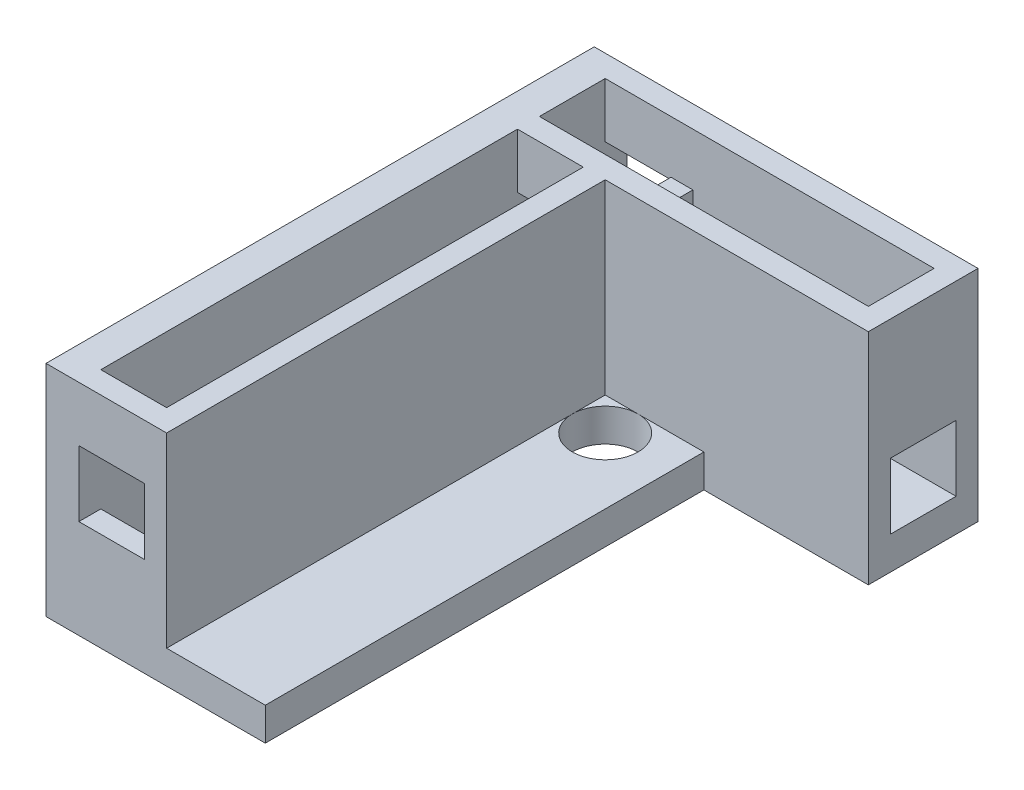
ISO-10303-21;
HEADER;
FILE_DESCRIPTION(('STEP AP214'),'2;1');
FILE_NAME('part.step','',(''),(''),'','','');
FILE_SCHEMA(('AUTOMOTIVE_DESIGN { 1 0 10303 214 1 1 1 1 }'));
ENDSEC;
DATA;
#1=APPLICATION_CONTEXT('core data for automotive mechanical design processes');
#2=APPLICATION_PROTOCOL_DEFINITION('international standard','automotive_design',2000,#1);
#3=PRODUCT_CONTEXT('',#1,'mechanical');
#4=PRODUCT('Part','Part','',(#3));
#5=PRODUCT_RELATED_PRODUCT_CATEGORY('part','',(#4));
#6=PRODUCT_DEFINITION_FORMATION('','',#4);
#7=PRODUCT_DEFINITION_CONTEXT('part definition',#1,'design');
#8=PRODUCT_DEFINITION('design','',#6,#7);
#9=PRODUCT_DEFINITION_SHAPE('','',#8);
#10=(LENGTH_UNIT() NAMED_UNIT(*) SI_UNIT(.MILLI.,.METRE.));
#11=(NAMED_UNIT(*) PLANE_ANGLE_UNIT() SI_UNIT($,.RADIAN.));
#12=(NAMED_UNIT(*) SI_UNIT($,.STERADIAN.) SOLID_ANGLE_UNIT());
#13=UNCERTAINTY_MEASURE_WITH_UNIT(LENGTH_MEASURE(1.E-05),#10,'distance_accuracy_value','');
#14=(GEOMETRIC_REPRESENTATION_CONTEXT(3) GLOBAL_UNCERTAINTY_ASSIGNED_CONTEXT((#13)) GLOBAL_UNIT_ASSIGNED_CONTEXT((#10,
#11,#12)) REPRESENTATION_CONTEXT('',''));
#15=CARTESIAN_POINT('',(0.,0.,0.));
#16=DIRECTION('',(0.,0.,1.));
#17=DIRECTION('',(1.,0.,0.));
#18=AXIS2_PLACEMENT_3D('',#15,#16,#17);
#19=CARTESIAN_POINT('',(35.,2.,10.));
#20=DIRECTION('',(0.,-1.,0.));
#21=DIRECTION('',(0.,0.,1.));
#22=AXIS2_PLACEMENT_3D('',#19,#20,#21);
#23=PLANE('',#22);
#24=DIRECTION('',(1.,0.,0.));
#25=VECTOR('',#24,1.);
#26=CARTESIAN_POINT('',(35.,2.,10.));
#27=LINE('',#26,#25);
#28=CARTESIAN_POINT('',(11.,2.,10.));
#29=VERTEX_POINT('',#28);
#30=CARTESIAN_POINT('',(14.,2.,10.));
#31=VERTEX_POINT('',#30);
#32=EDGE_CURVE('E286',#29,#31,#27,.T.);
#33=ORIENTED_EDGE('',*,*,#32,.F.);
#34=DIRECTION('',(0.,0.,-1.));
#35=VECTOR('',#34,1.);
#36=CARTESIAN_POINT('',(11.,2.,10.));
#37=LINE('',#36,#35);
#38=CARTESIAN_POINT('',(11.,2.,13.));
#39=VERTEX_POINT('',#38);
#40=EDGE_CURVE('E276',#39,#29,#37,.T.);
#41=ORIENTED_EDGE('',*,*,#40,.F.);
#42=CARTESIAN_POINT('',(14.,2.,13.));
#43=DIRECTION('',(0.,-1.,0.));
#44=DIRECTION('',(0.,0.,-1.));
#45=AXIS2_PLACEMENT_3D('',#42,#43,#44);
#46=CIRCLE('',#45,3.);
#47=EDGE_CURVE('E269',#39,#31,#46,.T.);
#48=ORIENTED_EDGE('',*,*,#47,.T.);
#49=EDGE_LOOP('',(#33,#41,#48));
#50=FACE_BOUND('',#49,.T.);
#51=ADVANCED_FACE('F33',(#50),#23,.F.);
#52=CARTESIAN_POINT('',(3.00000000000001,8.,19.3532580399902));
#53=DIRECTION('',(1.,0.,0.));
#54=DIRECTION('',(0.,0.,1.));
#55=AXIS2_PLACEMENT_3D('',#52,#53,#54);
#56=PLANE('',#55);
#57=DIRECTION('',(0.,-1.,0.));
#58=VECTOR('',#57,1.);
#59=CARTESIAN_POINT('',(3.00000000000001,14.2,50.));
#60=LINE('',#59,#58);
#61=CARTESIAN_POINT('',(3.00000000000001,14.,50.));
#62=VERTEX_POINT('',#61);
#63=CARTESIAN_POINT('',(3.00000000000001,8.,50.));
#64=VERTEX_POINT('',#63);
#65=EDGE_CURVE('E529',#62,#64,#60,.T.);
#66=ORIENTED_EDGE('',*,*,#65,.T.);
#67=DIRECTION('',(0.,0.,-1.));
#68=VECTOR('',#67,1.);
#69=CARTESIAN_POINT('',(3.00000000000001,8.,19.3532580399902));
#70=LINE('',#69,#68);
#71=CARTESIAN_POINT('',(3.00000000000001,8.,48.));
#72=VERTEX_POINT('',#71);
#73=EDGE_CURVE('E519',#64,#72,#70,.T.);
#74=ORIENTED_EDGE('',*,*,#73,.T.);
#75=DIRECTION('',(0.,-1.,0.));
#76=VECTOR('',#75,1.);
#77=CARTESIAN_POINT('',(3.00000000000001,8.,48.));
#78=LINE('',#77,#76);
#79=CARTESIAN_POINT('',(3.00000000000001,2.,48.));
#80=VERTEX_POINT('',#79);
#81=EDGE_CURVE('E421',#72,#80,#78,.T.);
#82=ORIENTED_EDGE('',*,*,#81,.T.);
#83=DIRECTION('',(0.,0.,-1.));
#84=VECTOR('',#83,1.);
#85=CARTESIAN_POINT('',(3.00000000000001,2.,10.));
#86=LINE('',#85,#84);
#87=CARTESIAN_POINT('',(3.00000000000001,2.,10.));
#88=VERTEX_POINT('',#87);
#89=EDGE_CURVE('E293',#80,#88,#86,.T.);
#90=ORIENTED_EDGE('',*,*,#89,.T.);
#91=DIRECTION('',(0.,-1.,0.));
#92=VECTOR('',#91,1.);
#93=CARTESIAN_POINT('',(3.00000000000001,8.,10.));
#94=LINE('',#93,#92);
#95=CARTESIAN_POINT('',(3.00000000000001,8.,10.));
#96=VERTEX_POINT('',#95);
#97=EDGE_CURVE('E287',#96,#88,#94,.T.);
#98=ORIENTED_EDGE('',*,*,#97,.F.);
#99=CARTESIAN_POINT('',(3.00000000000001,8.,8.));
#100=VERTEX_POINT('',#99);
#101=EDGE_CURVE('E522',#96,#100,#70,.T.);
#102=ORIENTED_EDGE('',*,*,#101,.T.);
#103=CARTESIAN_POINT('',(3.00000000000001,8.,1.99999999999999));
#104=VERTEX_POINT('',#103);
#105=EDGE_CURVE('E565',#100,#104,#70,.T.);
#106=ORIENTED_EDGE('',*,*,#105,.T.);
#107=CARTESIAN_POINT('',(3.00000000000001,8.,0.));
#108=VERTEX_POINT('',#107);
#109=EDGE_CURVE('E523',#104,#108,#70,.T.);
#110=ORIENTED_EDGE('',*,*,#109,.T.);
#111=DIRECTION('',(0.,-1.,0.));
#112=VECTOR('',#111,1.);
#113=CARTESIAN_POINT('',(3.00000000000001,14.2,0.));
#114=LINE('',#113,#112);
#115=CARTESIAN_POINT('',(3.00000000000001,14.,0.));
#116=VERTEX_POINT('',#115);
#117=EDGE_CURVE('E526',#116,#108,#114,.T.);
#118=ORIENTED_EDGE('',*,*,#117,.F.);
#119=DIRECTION('',(0.,0.,-1.));
#120=VECTOR('',#119,1.);
#121=CARTESIAN_POINT('',(3.00000000000001,14.,19.3532580399902));
#122=LINE('',#121,#120);
#123=CARTESIAN_POINT('',(3.00000000000001,14.,2.));
#124=VERTEX_POINT('',#123);
#125=EDGE_CURVE('E514',#124,#116,#122,.T.);
#126=ORIENTED_EDGE('',*,*,#125,.F.);
#127=DIRECTION('',(0.,-1.,0.));
#128=VECTOR('',#127,1.);
#129=CARTESIAN_POINT('',(3.00000000000001,19.,2.));
#130=LINE('',#129,#128);
#131=CARTESIAN_POINT('',(3.00000000000001,19.,2.));
#132=VERTEX_POINT('',#131);
#133=EDGE_CURVE('E489',#132,#124,#130,.T.);
#134=ORIENTED_EDGE('',*,*,#133,.F.);
#135=DIRECTION('',(0.,0.,-1.));
#136=VECTOR('',#135,1.);
#137=CARTESIAN_POINT('',(3.00000000000001,19.,19.3532580399902));
#138=LINE('',#137,#136);
#139=CARTESIAN_POINT('',(3.00000000000001,19.,8.));
#140=VERTEX_POINT('',#139);
#141=EDGE_CURVE('E462',#140,#132,#138,.T.);
#142=ORIENTED_EDGE('',*,*,#141,.F.);
#143=DIRECTION('',(0.,-1.,0.));
#144=VECTOR('',#143,1.);
#145=CARTESIAN_POINT('',(3.00000000000001,19.,8.));
#146=LINE('',#145,#144);
#147=CARTESIAN_POINT('',(3.00000000000001,14.,8.));
#148=VERTEX_POINT('',#147);
#149=EDGE_CURVE('E492',#140,#148,#146,.T.);
#150=ORIENTED_EDGE('',*,*,#149,.T.);
#151=CARTESIAN_POINT('',(3.00000000000001,14.,10.));
#152=VERTEX_POINT('',#151);
#153=EDGE_CURVE('E517',#152,#148,#122,.T.);
#154=ORIENTED_EDGE('',*,*,#153,.F.);
#155=DIRECTION('',(0.,-1.,0.));
#156=VECTOR('',#155,1.);
#157=CARTESIAN_POINT('',(3.00000000000001,19.,10.));
#158=LINE('',#157,#156);
#159=CARTESIAN_POINT('',(3.00000000000001,19.,10.));
#160=VERTEX_POINT('',#159);
#161=EDGE_CURVE('E476',#160,#152,#158,.T.);
#162=ORIENTED_EDGE('',*,*,#161,.F.);
#163=DIRECTION('',(0.,0.,-1.));
#164=VECTOR('',#163,1.);
#165=CARTESIAN_POINT('',(3.00000000000001,19.,19.3532580399902));
#166=LINE('',#165,#164);
#167=CARTESIAN_POINT('',(3.00000000000001,19.,48.));
#168=VERTEX_POINT('',#167);
#169=EDGE_CURVE('E488',#168,#160,#166,.T.);
#170=ORIENTED_EDGE('',*,*,#169,.F.);
#171=DIRECTION('',(0.,-1.,0.));
#172=VECTOR('',#171,1.);
#173=CARTESIAN_POINT('',(3.00000000000001,19.,48.));
#174=LINE('',#173,#172);
#175=CARTESIAN_POINT('',(3.00000000000001,14.,48.));
#176=VERTEX_POINT('',#175);
#177=EDGE_CURVE('E493',#168,#176,#174,.T.);
#178=ORIENTED_EDGE('',*,*,#177,.T.);
#179=EDGE_CURVE('E518',#62,#176,#122,.T.);
#180=ORIENTED_EDGE('',*,*,#179,.F.);
#181=EDGE_LOOP('',(#66,#74,#82,#90,#98,#102,#106,#110,#118,#126,#134,#142,#150,#154,#162,#170,
#178,#180));
#182=FACE_BOUND('',#181,.T.);
#183=ADVANCED_FACE('F433',(#182),#56,.T.);
#184=CARTESIAN_POINT('',(9.00000000000001,8.,19.3532580399902));
#185=DIRECTION('',(1.,0.,0.));
#186=DIRECTION('',(0.,0.,1.));
#187=AXIS2_PLACEMENT_3D('',#184,#185,#186);
#188=PLANE('',#187);
#189=DIRECTION('',(0.,0.,-1.));
#190=VECTOR('',#189,1.);
#191=CARTESIAN_POINT('',(9.00000000000001,14.2,19.3532580399902));
#192=LINE('',#191,#190);
#193=CARTESIAN_POINT('',(9.00000000000001,14.2,8.));
#194=VERTEX_POINT('',#193);
#195=CARTESIAN_POINT('',(9.00000000000001,14.2,2.));
#196=VERTEX_POINT('',#195);
#197=EDGE_CURVE('E382',#194,#196,#192,.T.);
#198=ORIENTED_EDGE('',*,*,#197,.T.);
#199=DIRECTION('',(0.,-1.,0.));
#200=VECTOR('',#199,1.);
#201=CARTESIAN_POINT('',(9.00000000000001,8.,1.99999999999999));
#202=LINE('',#201,#200);
#203=CARTESIAN_POINT('',(9.00000000000001,14.,2.));
#204=VERTEX_POINT('',#203);
#205=EDGE_CURVE('E377',#196,#204,#202,.T.);
#206=ORIENTED_EDGE('',*,*,#205,.T.);
#207=DIRECTION('',(0.,0.,-1.));
#208=VECTOR('',#207,1.);
#209=CARTESIAN_POINT('',(9.00000000000001,14.,19.3532580399902));
#210=LINE('',#209,#208);
#211=CARTESIAN_POINT('',(9.00000000000001,14.,0.));
#212=VERTEX_POINT('',#211);
#213=EDGE_CURVE('E509',#204,#212,#210,.T.);
#214=ORIENTED_EDGE('',*,*,#213,.T.);
#215=DIRECTION('',(0.,-1.,0.));
#216=VECTOR('',#215,1.);
#217=CARTESIAN_POINT('',(9.00000000000001,14.2,0.));
#218=LINE('',#217,#216);
#219=CARTESIAN_POINT('',(9.00000000000001,8.,0.));
#220=VERTEX_POINT('',#219);
#221=EDGE_CURVE('E403',#212,#220,#218,.T.);
#222=ORIENTED_EDGE('',*,*,#221,.T.);
#223=DIRECTION('',(0.,0.,-1.));
#224=VECTOR('',#223,1.);
#225=CARTESIAN_POINT('',(9.00000000000001,8.,19.3532580399902));
#226=LINE('',#225,#224);
#227=CARTESIAN_POINT('',(9.00000000000001,8.,2.));
#228=VERTEX_POINT('',#227);
#229=EDGE_CURVE('E542',#228,#220,#226,.T.);
#230=ORIENTED_EDGE('',*,*,#229,.F.);
#231=CARTESIAN_POINT('',(9.00000000000001,8.,8.));
#232=VERTEX_POINT('',#231);
#233=EDGE_CURVE('E654',#232,#228,#226,.T.);
#234=ORIENTED_EDGE('',*,*,#233,.F.);
#235=CARTESIAN_POINT('',(9.00000000000001,8.,10.));
#236=VERTEX_POINT('',#235);
#237=EDGE_CURVE('E545',#236,#232,#226,.T.);
#238=ORIENTED_EDGE('',*,*,#237,.F.);
#239=DIRECTION('',(0.,-1.,0.));
#240=VECTOR('',#239,1.);
#241=CARTESIAN_POINT('',(9.00000000000001,8.,10.));
#242=LINE('',#241,#240);
#243=CARTESIAN_POINT('',(9.00000000000001,2.,10.));
#244=VERTEX_POINT('',#243);
#245=EDGE_CURVE('E415',#236,#244,#242,.T.);
#246=ORIENTED_EDGE('',*,*,#245,.T.);
#247=DIRECTION('',(0.,0.,-1.));
#248=VECTOR('',#247,1.);
#249=CARTESIAN_POINT('',(9.00000000000001,2.,10.));
#250=LINE('',#249,#248);
#251=CARTESIAN_POINT('',(9.,2.,48.));
#252=VERTEX_POINT('',#251);
#253=EDGE_CURVE('E281',#252,#244,#250,.T.);
#254=ORIENTED_EDGE('',*,*,#253,.F.);
#255=DIRECTION('',(0.,-1.,0.));
#256=VECTOR('',#255,1.);
#257=CARTESIAN_POINT('',(9.00000000000001,8.,48.));
#258=LINE('',#257,#256);
#259=CARTESIAN_POINT('',(9.00000000000001,8.,48.));
#260=VERTEX_POINT('',#259);
#261=EDGE_CURVE('E418',#260,#252,#258,.T.);
#262=ORIENTED_EDGE('',*,*,#261,.F.);
#263=CARTESIAN_POINT('',(9.00000000000001,8.,50.));
#264=VERTEX_POINT('',#263);
#265=EDGE_CURVE('E387',#264,#260,#226,.T.);
#266=ORIENTED_EDGE('',*,*,#265,.F.);
#267=DIRECTION('',(0.,-1.,0.));
#268=VECTOR('',#267,1.);
#269=CARTESIAN_POINT('',(9.00000000000001,14.2,50.));
#270=LINE('',#269,#268);
#271=CARTESIAN_POINT('',(9.00000000000001,14.,50.));
#272=VERTEX_POINT('',#271);
#273=EDGE_CURVE('E407',#272,#264,#270,.T.);
#274=ORIENTED_EDGE('',*,*,#273,.F.);
#275=CARTESIAN_POINT('',(9.00000000000001,14.,48.));
#276=VERTEX_POINT('',#275);
#277=EDGE_CURVE('E513',#272,#276,#210,.T.);
#278=ORIENTED_EDGE('',*,*,#277,.T.);
#279=DIRECTION('',(0.,-1.,0.));
#280=VECTOR('',#279,1.);
#281=CARTESIAN_POINT('',(9.00000000000001,19.,48.));
#282=LINE('',#281,#280);
#283=CARTESIAN_POINT('',(9.00000000000001,19.,48.));
#284=VERTEX_POINT('',#283);
#285=EDGE_CURVE('E501',#284,#276,#282,.T.);
#286=ORIENTED_EDGE('',*,*,#285,.F.);
#287=DIRECTION('',(0.,0.,-1.));
#288=VECTOR('',#287,1.);
#289=CARTESIAN_POINT('',(9.00000000000001,19.,19.3532580399902));
#290=LINE('',#289,#288);
#291=CARTESIAN_POINT('',(9.00000000000001,19.,10.));
#292=VERTEX_POINT('',#291);
#293=EDGE_CURVE('E721',#284,#292,#290,.T.);
#294=ORIENTED_EDGE('',*,*,#293,.T.);
#295=DIRECTION('',(0.,-1.,0.));
#296=VECTOR('',#295,1.);
#297=CARTESIAN_POINT('',(9.00000000000001,19.,10.));
#298=LINE('',#297,#296);
#299=CARTESIAN_POINT('',(9.00000000000001,14.,10.));
#300=VERTEX_POINT('',#299);
#301=EDGE_CURVE('E498',#292,#300,#298,.T.);
#302=ORIENTED_EDGE('',*,*,#301,.T.);
#303=CARTESIAN_POINT('',(9.00000000000001,14.,8.));
#304=VERTEX_POINT('',#303);
#305=EDGE_CURVE('E512',#300,#304,#210,.T.);
#306=ORIENTED_EDGE('',*,*,#305,.T.);
#307=DIRECTION('',(0.,-1.,0.));
#308=VECTOR('',#307,1.);
#309=CARTESIAN_POINT('',(9.00000000000001,8.,8.));
#310=LINE('',#309,#308);
#311=EDGE_CURVE('E506',#194,#304,#310,.T.);
#312=ORIENTED_EDGE('',*,*,#311,.F.);
#313=EDGE_LOOP('',(#198,#206,#214,#222,#230,#234,#238,#246,#254,#262,#266,#274,#278,#286,#294,
#302,#306,#312));
#314=FACE_BOUND('',#313,.T.);
#315=ADVANCED_FACE('F558',(#314),#188,.F.);
#316=CARTESIAN_POINT('',(-55.6237513405793,8.,19.3532580399902));
#317=DIRECTION('',(0.,1.,0.));
#318=DIRECTION('',(0.,0.,-1.));
#319=AXIS2_PLACEMENT_3D('',#316,#317,#318);
#320=PLANE('',#319);
#321=ORIENTED_EDGE('',*,*,#101,.F.);
#322=DIRECTION('',(1.,0.,0.));
#323=VECTOR('',#322,1.);
#324=CARTESIAN_POINT('',(-55.6237513405793,8.,10.));
#325=LINE('',#324,#323);
#326=EDGE_CURVE('E300',#96,#236,#325,.T.);
#327=ORIENTED_EDGE('',*,*,#326,.T.);
#328=ORIENTED_EDGE('',*,*,#237,.T.);
#329=DIRECTION('',(-1.,0.,0.));
#330=VECTOR('',#329,1.);
#331=CARTESIAN_POINT('',(-55.6237513405793,8.,7.99999999999999));
#332=LINE('',#331,#330);
#333=EDGE_CURVE('E296',#232,#100,#332,.T.);
#334=ORIENTED_EDGE('',*,*,#333,.T.);
#335=EDGE_LOOP('',(#321,#327,#328,#334));
#336=FACE_BOUND('',#335,.T.);
#337=ADVANCED_FACE('F660',(#336),#320,.T.);
#338=CARTESIAN_POINT('',(-55.6237513405793,8.,19.3532580399902));
#339=DIRECTION('',(0.,1.,0.));
#340=DIRECTION('',(0.,0.,-1.));
#341=AXIS2_PLACEMENT_3D('',#338,#339,#340);
#342=PLANE('',#341);
#343=ORIENTED_EDGE('',*,*,#109,.F.);
#344=DIRECTION('',(-1.,0.,0.));
#345=VECTOR('',#344,1.);
#346=CARTESIAN_POINT('',(-55.6237513405793,8.,1.99999999999999));
#347=LINE('',#346,#345);
#348=EDGE_CURVE('E313',#228,#104,#347,.T.);
#349=ORIENTED_EDGE('',*,*,#348,.F.);
#350=ORIENTED_EDGE('',*,*,#229,.T.);
#351=DIRECTION('',(1.,0.,0.));
#352=VECTOR('',#351,1.);
#353=CARTESIAN_POINT('',(-55.6237513405793,8.,0.));
#354=LINE('',#353,#352);
#355=EDGE_CURVE('E311',#108,#220,#354,.T.);
#356=ORIENTED_EDGE('',*,*,#355,.F.);
#357=EDGE_LOOP('',(#343,#349,#350,#356));
#358=FACE_BOUND('',#357,.T.);
#359=ADVANCED_FACE('F652',(#358),#342,.T.);
#360=ORIENTED_EDGE('',*,*,#73,.F.);
#361=DIRECTION('',(1.,0.,0.));
#362=VECTOR('',#361,1.);
#363=CARTESIAN_POINT('',(-55.6237513405793,8.,50.));
#364=LINE('',#363,#362);
#365=EDGE_CURVE('E409',#64,#264,#364,.T.);
#366=ORIENTED_EDGE('',*,*,#365,.T.);
#367=ORIENTED_EDGE('',*,*,#265,.T.);
#368=DIRECTION('',(1.,0.,0.));
#369=VECTOR('',#368,1.);
#370=CARTESIAN_POINT('',(-55.6237513405793,8.,48.));
#371=LINE('',#370,#369);
#372=EDGE_CURVE('E411',#72,#260,#371,.T.);
#373=ORIENTED_EDGE('',*,*,#372,.F.);
#374=EDGE_LOOP('',(#360,#366,#367,#373));
#375=FACE_BOUND('',#374,.T.);
#376=ADVANCED_FACE('F560',(#375),#320,.T.);
#377=CARTESIAN_POINT('',(11.,2.,50.));
#378=VERTEX_POINT('',#377);
#379=EDGE_CURVE('E264',#378,#39,#37,.T.);
#380=ORIENTED_EDGE('',*,*,#379,.F.);
#381=DIRECTION('',(1.,0.,0.));
#382=VECTOR('',#381,1.);
#383=CARTESIAN_POINT('',(0.,2.,50.));
#384=LINE('',#383,#382);
#385=CARTESIAN_POINT('',(20.,2.,50.));
#386=VERTEX_POINT('',#385);
#387=EDGE_CURVE('E327',#378,#386,#384,.T.);
#388=ORIENTED_EDGE('',*,*,#387,.T.);
#389=DIRECTION('',(0.,0.,-1.));
#390=VECTOR('',#389,1.);
#391=CARTESIAN_POINT('',(20.,2.,50.));
#392=LINE('',#391,#390);
#393=CARTESIAN_POINT('',(20.,2.,10.));
#394=VERTEX_POINT('',#393);
#395=EDGE_CURVE('E329',#386,#394,#392,.T.);
#396=ORIENTED_EDGE('',*,*,#395,.T.);
#397=EDGE_CURVE('E267',#31,#394,#27,.T.);
#398=ORIENTED_EDGE('',*,*,#397,.F.);
#399=EDGE_CURVE('E48',#31,#39,#46,.T.);
#400=ORIENTED_EDGE('',*,*,#399,.T.);
#401=EDGE_LOOP('',(#380,#388,#396,#398,#400));
#402=FACE_BOUND('',#401,.T.);
#403=ADVANCED_FACE('F262',(#402),#23,.F.);
#404=CARTESIAN_POINT('',(20.,-1.,10.));
#405=DIRECTION('',(0.,0.,-1.));
#406=DIRECTION('',(1.,0.,0.));
#407=AXIS2_PLACEMENT_3D('',#404,#405,#406);
#408=PLANE('',#407);
#409=EDGE_CURVE('E307',#88,#244,#27,.T.);
#410=ORIENTED_EDGE('',*,*,#409,.T.);
#411=ORIENTED_EDGE('',*,*,#245,.F.);
#412=ORIENTED_EDGE('',*,*,#326,.F.);
#413=ORIENTED_EDGE('',*,*,#97,.T.);
#414=EDGE_LOOP('',(#410,#411,#412,#413));
#415=FACE_BOUND('',#414,.T.);
#416=ADVANCED_FACE('F426',(#415),#408,.F.);
#417=DIRECTION('',(0.,0.,-1.));
#418=VECTOR('',#417,1.);
#419=CARTESIAN_POINT('',(35.,2.,10.));
#420=LINE('',#419,#418);
#421=CARTESIAN_POINT('',(35.,2.,8.));
#422=VERTEX_POINT('',#421);
#423=CARTESIAN_POINT('',(35.,2.,2.));
#424=VERTEX_POINT('',#423);
#425=EDGE_CURVE('E321',#422,#424,#420,.T.);
#426=ORIENTED_EDGE('',*,*,#425,.T.);
#427=DIRECTION('',(-1.,0.,0.));
#428=VECTOR('',#427,1.);
#429=CARTESIAN_POINT('',(35.,2.,2.));
#430=LINE('',#429,#428);
#431=CARTESIAN_POINT('',(0.,2.,1.99999999999999));
#432=VERTEX_POINT('',#431);
#433=EDGE_CURVE('E363',#424,#432,#430,.T.);
#434=ORIENTED_EDGE('',*,*,#433,.T.);
#435=DIRECTION('',(0.,0.,1.));
#436=VECTOR('',#435,1.);
#437=CARTESIAN_POINT('',(0.,2.,0.));
#438=LINE('',#437,#436);
#439=CARTESIAN_POINT('',(0.,2.,8.));
#440=VERTEX_POINT('',#439);
#441=EDGE_CURVE('E324',#432,#440,#438,.T.);
#442=ORIENTED_EDGE('',*,*,#441,.T.);
#443=DIRECTION('',(-1.,0.,0.));
#444=VECTOR('',#443,1.);
#445=CARTESIAN_POINT('',(35.,2.,8.));
#446=LINE('',#445,#444);
#447=EDGE_CURVE('E308',#422,#440,#446,.T.);
#448=ORIENTED_EDGE('',*,*,#447,.F.);
#449=EDGE_LOOP('',(#426,#434,#442,#448));
#450=FACE_BOUND('',#449,.T.);
#451=ADVANCED_FACE('F608',(#450),#23,.F.);
#452=DIRECTION('',(1.,0.,0.));
#453=VECTOR('',#452,1.);
#454=CARTESIAN_POINT('',(35.,2.,48.));
#455=LINE('',#454,#453);
#456=EDGE_CURVE('E366',#80,#252,#455,.T.);
#457=ORIENTED_EDGE('',*,*,#456,.T.);
#458=ORIENTED_EDGE('',*,*,#253,.T.);
#459=ORIENTED_EDGE('',*,*,#409,.F.);
#460=ORIENTED_EDGE('',*,*,#89,.F.);
#461=EDGE_LOOP('',(#457,#458,#459,#460));
#462=FACE_BOUND('',#461,.T.);
#463=ADVANCED_FACE('F437',(#462),#23,.F.);
#464=DIRECTION('',(1.,0.,0.));
#465=VECTOR('',#464,1.);
#466=CARTESIAN_POINT('',(-55.6237513405793,19.,10.));
#467=LINE('',#466,#465);
#468=CARTESIAN_POINT('',(11.,19.,10.));
#469=VERTEX_POINT('',#468);
#470=CARTESIAN_POINT('',(35.,19.,10.));
#471=VERTEX_POINT('',#470);
#472=EDGE_CURVE('E451',#469,#471,#467,.T.);
#473=ORIENTED_EDGE('',*,*,#472,.F.);
#474=DIRECTION('',(0.,-1.,0.));
#475=VECTOR('',#474,1.);
#476=CARTESIAN_POINT('',(11.,8.,10.));
#477=LINE('',#476,#475);
#478=EDGE_CURVE('E413',#469,#29,#477,.T.);
#479=ORIENTED_EDGE('',*,*,#478,.T.);
#480=ORIENTED_EDGE('',*,*,#32,.T.);
#481=ORIENTED_EDGE('',*,*,#397,.T.);
#482=DIRECTION('',(0.,1.,0.));
#483=VECTOR('',#482,1.);
#484=CARTESIAN_POINT('',(20.,-1.,10.));
#485=LINE('',#484,#483);
#486=CARTESIAN_POINT('',(20.,-1.,10.));
#487=VERTEX_POINT('',#486);
#488=EDGE_CURVE('E347',#487,#394,#485,.T.);
#489=ORIENTED_EDGE('',*,*,#488,.F.);
#490=DIRECTION('',(1.,0.,0.));
#491=VECTOR('',#490,1.);
#492=CARTESIAN_POINT('',(20.,-1.,10.));
#493=LINE('',#492,#491);
#494=CARTESIAN_POINT('',(35.,-1.,10.));
#495=VERTEX_POINT('',#494);
#496=EDGE_CURVE('E331',#487,#495,#493,.T.);
#497=ORIENTED_EDGE('',*,*,#496,.T.);
#498=DIRECTION('',(0.,1.,0.));
#499=VECTOR('',#498,1.);
#500=CARTESIAN_POINT('',(35.,-1.,10.));
#501=LINE('',#500,#499);
#502=EDGE_CURVE('E360',#495,#471,#501,.T.);
#503=ORIENTED_EDGE('',*,*,#502,.T.);
#504=EDGE_LOOP('',(#473,#479,#480,#481,#489,#497,#503));
#505=FACE_BOUND('',#504,.T.);
#506=ADVANCED_FACE('F35',(#505),#408,.F.);
#507=CARTESIAN_POINT('',(35.,-1.,10.));
#508=DIRECTION('',(-1.,0.,0.));
#509=DIRECTION('',(0.,0.,-1.));
#510=AXIS2_PLACEMENT_3D('',#507,#508,#509);
#511=PLANE('',#510);
#512=DIRECTION('',(0.,0.,-1.));
#513=VECTOR('',#512,1.);
#514=CARTESIAN_POINT('',(35.,19.,19.3532580399902));
#515=LINE('',#514,#513);
#516=CARTESIAN_POINT('',(35.,19.,0.));
#517=VERTEX_POINT('',#516);
#518=EDGE_CURVE('E459',#471,#517,#515,.T.);
#519=ORIENTED_EDGE('',*,*,#518,.F.);
#520=ORIENTED_EDGE('',*,*,#502,.F.);
#521=DIRECTION('',(0.,0.,-1.));
#522=VECTOR('',#521,1.);
#523=CARTESIAN_POINT('',(35.,-1.,10.));
#524=LINE('',#523,#522);
#525=CARTESIAN_POINT('',(35.,-1.,0.));
#526=VERTEX_POINT('',#525);
#527=EDGE_CURVE('E334',#495,#526,#524,.T.);
#528=ORIENTED_EDGE('',*,*,#527,.T.);
#529=DIRECTION('',(0.,1.,0.));
#530=VECTOR('',#529,1.);
#531=CARTESIAN_POINT('',(35.,-1.,0.));
#532=LINE('',#531,#530);
#533=EDGE_CURVE('E357',#526,#517,#532,.T.);
#534=ORIENTED_EDGE('',*,*,#533,.T.);
#535=EDGE_LOOP('',(#519,#520,#528,#534));
#536=FACE_BOUND('',#535,.T.);
#537=DIRECTION('',(0.,-1.,0.));
#538=VECTOR('',#537,1.);
#539=CARTESIAN_POINT('',(35.,8.,2.));
#540=LINE('',#539,#538);
#541=CARTESIAN_POINT('',(35.,8.,2.));
#542=VERTEX_POINT('',#541);
#543=EDGE_CURVE('E319',#542,#424,#540,.T.);
#544=ORIENTED_EDGE('',*,*,#543,.T.);
#545=ORIENTED_EDGE('',*,*,#425,.F.);
#546=DIRECTION('',(0.,-1.,0.));
#547=VECTOR('',#546,1.);
#548=CARTESIAN_POINT('',(35.,8.,8.));
#549=LINE('',#548,#547);
#550=CARTESIAN_POINT('',(35.,8.,8.));
#551=VERTEX_POINT('',#550);
#552=EDGE_CURVE('E304',#551,#422,#549,.T.);
#553=ORIENTED_EDGE('',*,*,#552,.F.);
#554=DIRECTION('',(0.,0.,-1.));
#555=VECTOR('',#554,1.);
#556=CARTESIAN_POINT('',(35.,8.,19.3532580399902));
#557=LINE('',#556,#555);
#558=EDGE_CURVE('E539',#551,#542,#557,.T.);
#559=ORIENTED_EDGE('',*,*,#558,.T.);
#560=EDGE_LOOP('',(#544,#545,#553,#559));
#561=FACE_BOUND('',#560,.T.);
#562=ADVANCED_FACE('F614',(#536,#561),#511,.F.);
#563=CARTESIAN_POINT('',(0.,-1.,0.));
#564=DIRECTION('',(0.,0.,-1.));
#565=DIRECTION('',(1.,0.,0.));
#566=AXIS2_PLACEMENT_3D('',#563,#564,#565);
#567=PLANE('',#566);
#568=DIRECTION('',(1.,0.,0.));
#569=VECTOR('',#568,1.);
#570=CARTESIAN_POINT('',(-55.6237513405793,14.,0.));
#571=LINE('',#570,#569);
#572=EDGE_CURVE('E482',#116,#212,#571,.T.);
#573=ORIENTED_EDGE('',*,*,#572,.F.);
#574=ORIENTED_EDGE('',*,*,#117,.T.);
#575=ORIENTED_EDGE('',*,*,#355,.T.);
#576=ORIENTED_EDGE('',*,*,#221,.F.);
#577=EDGE_LOOP('',(#573,#574,#575,#576));
#578=FACE_BOUND('',#577,.T.);
#579=DIRECTION('',(1.,0.,0.));
#580=VECTOR('',#579,1.);
#581=CARTESIAN_POINT('',(-55.6237513405793,19.,0.));
#582=LINE('',#581,#580);
#583=CARTESIAN_POINT('',(0.,19.,0.));
#584=VERTEX_POINT('',#583);
#585=EDGE_CURVE('E464',#584,#517,#582,.T.);
#586=ORIENTED_EDGE('',*,*,#585,.T.);
#587=ORIENTED_EDGE('',*,*,#533,.F.);
#588=DIRECTION('',(1.,0.,0.));
#589=VECTOR('',#588,1.);
#590=CARTESIAN_POINT('',(0.,-1.,0.));
#591=LINE('',#590,#589);
#592=CARTESIAN_POINT('',(0.,-1.,0.));
#593=VERTEX_POINT('',#592);
#594=EDGE_CURVE('E337',#593,#526,#591,.T.);
#595=ORIENTED_EDGE('',*,*,#594,.F.);
#596=DIRECTION('',(0.,1.,0.));
#597=VECTOR('',#596,1.);
#598=CARTESIAN_POINT('',(0.,-1.,0.));
#599=LINE('',#598,#597);
#600=EDGE_CURVE('E354',#593,#584,#599,.T.);
#601=ORIENTED_EDGE('',*,*,#600,.T.);
#602=EDGE_LOOP('',(#586,#587,#595,#601));
#603=FACE_BOUND('',#602,.T.);
#604=ADVANCED_FACE('F647',(#578,#603),#567,.T.);
#605=CARTESIAN_POINT('',(0.,-1.,0.));
#606=DIRECTION('',(1.,0.,0.));
#607=DIRECTION('',(0.,0.,1.));
#608=AXIS2_PLACEMENT_3D('',#605,#606,#607);
#609=PLANE('',#608);
#610=DIRECTION('',(0.,0.,1.));
#611=VECTOR('',#610,1.);
#612=CARTESIAN_POINT('',(0.,19.,19.3532580399902));
#613=LINE('',#612,#611);
#614=CARTESIAN_POINT('',(0.,19.,50.));
#615=VERTEX_POINT('',#614);
#616=EDGE_CURVE('E714',#584,#615,#613,.T.);
#617=ORIENTED_EDGE('',*,*,#616,.F.);
#618=ORIENTED_EDGE('',*,*,#600,.F.);
#619=DIRECTION('',(0.,0.,1.));
#620=VECTOR('',#619,1.);
#621=CARTESIAN_POINT('',(0.,-1.,0.));
#622=LINE('',#621,#620);
#623=CARTESIAN_POINT('',(0.,-1.,50.));
#624=VERTEX_POINT('',#623);
#625=EDGE_CURVE('E339',#593,#624,#622,.T.);
#626=ORIENTED_EDGE('',*,*,#625,.T.);
#627=DIRECTION('',(0.,1.,0.));
#628=VECTOR('',#627,1.);
#629=CARTESIAN_POINT('',(0.,-1.,50.));
#630=LINE('',#629,#628);
#631=EDGE_CURVE('E351',#624,#615,#630,.T.);
#632=ORIENTED_EDGE('',*,*,#631,.T.);
#633=EDGE_LOOP('',(#617,#618,#626,#632));
#634=FACE_BOUND('',#633,.T.);
#635=DIRECTION('',(0.,-1.,0.));
#636=VECTOR('',#635,1.);
#637=CARTESIAN_POINT('',(0.,8.,8.));
#638=LINE('',#637,#636);
#639=CARTESIAN_POINT('',(0.,8.,8.));
#640=VERTEX_POINT('',#639);
#641=EDGE_CURVE('E302',#640,#440,#638,.T.);
#642=ORIENTED_EDGE('',*,*,#641,.T.);
#643=ORIENTED_EDGE('',*,*,#441,.F.);
#644=DIRECTION('',(0.,-1.,0.));
#645=VECTOR('',#644,1.);
#646=CARTESIAN_POINT('',(0.,8.,1.99999999999999));
#647=LINE('',#646,#645);
#648=CARTESIAN_POINT('',(0.,8.,1.99999999999999));
#649=VERTEX_POINT('',#648);
#650=EDGE_CURVE('E317',#649,#432,#647,.T.);
#651=ORIENTED_EDGE('',*,*,#650,.F.);
#652=DIRECTION('',(0.,0.,1.));
#653=VECTOR('',#652,1.);
#654=CARTESIAN_POINT('',(0.,8.,19.3532580399902));
#655=LINE('',#654,#653);
#656=EDGE_CURVE('E521',#649,#640,#655,.T.);
#657=ORIENTED_EDGE('',*,*,#656,.T.);
#658=EDGE_LOOP('',(#642,#643,#651,#657));
#659=FACE_BOUND('',#658,.T.);
#660=ADVANCED_FACE('F631',(#634,#659),#609,.F.);
#661=CARTESIAN_POINT('',(0.,-1.,50.));
#662=DIRECTION('',(0.,0.,-1.));
#663=DIRECTION('',(1.,0.,0.));
#664=AXIS2_PLACEMENT_3D('',#661,#662,#663);
#665=PLANE('',#664);
#666=ORIENTED_EDGE('',*,*,#273,.T.);
#667=ORIENTED_EDGE('',*,*,#365,.F.);
#668=ORIENTED_EDGE('',*,*,#65,.F.);
#669=DIRECTION('',(1.,0.,0.));
#670=VECTOR('',#669,1.);
#671=CARTESIAN_POINT('',(-55.6237513405793,14.,50.));
#672=LINE('',#671,#670);
#673=EDGE_CURVE('E480',#62,#272,#672,.T.);
#674=ORIENTED_EDGE('',*,*,#673,.T.);
#675=EDGE_LOOP('',(#666,#667,#668,#674));
#676=FACE_BOUND('',#675,.T.);
#677=DIRECTION('',(0.,-1.,0.));
#678=VECTOR('',#677,1.);
#679=CARTESIAN_POINT('',(11.,8.,50.));
#680=LINE('',#679,#678);
#681=CARTESIAN_POINT('',(11.,19.,50.));
#682=VERTEX_POINT('',#681);
#683=EDGE_CURVE('E279',#682,#378,#680,.T.);
#684=ORIENTED_EDGE('',*,*,#683,.F.);
#685=DIRECTION('',(1.,0.,0.));
#686=VECTOR('',#685,1.);
#687=CARTESIAN_POINT('',(-55.6237513405793,19.,50.));
#688=LINE('',#687,#686);
#689=EDGE_CURVE('E715',#615,#682,#688,.T.);
#690=ORIENTED_EDGE('',*,*,#689,.F.);
#691=ORIENTED_EDGE('',*,*,#631,.F.);
#692=DIRECTION('',(1.,0.,0.));
#693=VECTOR('',#692,1.);
#694=CARTESIAN_POINT('',(0.,-1.,50.));
#695=LINE('',#694,#693);
#696=CARTESIAN_POINT('',(20.,-1.,50.));
#697=VERTEX_POINT('',#696);
#698=EDGE_CURVE('E342',#624,#697,#695,.T.);
#699=ORIENTED_EDGE('',*,*,#698,.T.);
#700=DIRECTION('',(0.,1.,0.));
#701=VECTOR('',#700,1.);
#702=CARTESIAN_POINT('',(20.,-1.,50.));
#703=LINE('',#702,#701);
#704=EDGE_CURVE('E349',#697,#386,#703,.T.);
#705=ORIENTED_EDGE('',*,*,#704,.T.);
#706=ORIENTED_EDGE('',*,*,#387,.F.);
#707=EDGE_LOOP('',(#684,#690,#691,#699,#705,#706));
#708=FACE_BOUND('',#707,.T.);
#709=ADVANCED_FACE('F551',(#676,#708),#665,.F.);
#710=CARTESIAN_POINT('',(20.,-1.,50.));
#711=DIRECTION('',(-1.,0.,0.));
#712=DIRECTION('',(0.,0.,-1.));
#713=AXIS2_PLACEMENT_3D('',#710,#711,#712);
#714=PLANE('',#713);
#715=ORIENTED_EDGE('',*,*,#704,.F.);
#716=DIRECTION('',(0.,0.,-1.));
#717=VECTOR('',#716,1.);
#718=CARTESIAN_POINT('',(20.,-1.,50.));
#719=LINE('',#718,#717);
#720=EDGE_CURVE('E345',#697,#487,#719,.T.);
#721=ORIENTED_EDGE('',*,*,#720,.T.);
#722=ORIENTED_EDGE('',*,*,#488,.T.);
#723=ORIENTED_EDGE('',*,*,#395,.F.);
#724=EDGE_LOOP('',(#715,#721,#722,#723));
#725=FACE_BOUND('',#724,.T.);
#726=ADVANCED_FACE('F445',(#725),#714,.F.);
#727=CARTESIAN_POINT('',(35.,-1.,10.));
#728=DIRECTION('',(0.,-1.,0.));
#729=DIRECTION('',(0.,0.,1.));
#730=AXIS2_PLACEMENT_3D('',#727,#728,#729);
#731=PLANE('',#730);
#732=CARTESIAN_POINT('',(14.,-1.,13.));
#733=DIRECTION('',(0.,1.,0.));
#734=DIRECTION('',(0.,0.,1.));
#735=AXIS2_PLACEMENT_3D('',#732,#733,#734);
#736=CIRCLE('',#735,3.);
#737=CARTESIAN_POINT('',(14.,-1.,16.));
#738=VERTEX_POINT('',#737);
#739=EDGE_CURVE('E37',#738,#738,#736,.T.);
#740=ORIENTED_EDGE('',*,*,#739,.T.);
#741=EDGE_LOOP('',(#740));
#742=FACE_BOUND('',#741,.T.);
#743=ORIENTED_EDGE('',*,*,#496,.F.);
#744=ORIENTED_EDGE('',*,*,#720,.F.);
#745=ORIENTED_EDGE('',*,*,#698,.F.);
#746=ORIENTED_EDGE('',*,*,#625,.F.);
#747=ORIENTED_EDGE('',*,*,#594,.T.);
#748=ORIENTED_EDGE('',*,*,#527,.F.);
#749=EDGE_LOOP('',(#743,#744,#745,#746,#747,#748));
#750=FACE_BOUND('',#749,.T.);
#751=ADVANCED_FACE('F448',(#742,#750),#731,.T.);
#752=CARTESIAN_POINT('',(-55.6237513405793,8.,1.99999999999999));
#753=DIRECTION('',(0.,0.,-1.));
#754=DIRECTION('',(1.,0.,0.));
#755=AXIS2_PLACEMENT_3D('',#752,#753,#754);
#756=PLANE('',#755);
#757=DIRECTION('',(0.,-1.,0.));
#758=VECTOR('',#757,1.);
#759=CARTESIAN_POINT('',(33.,14.2,2.));
#760=LINE('',#759,#758);
#761=CARTESIAN_POINT('',(33.,19.,2.));
#762=VERTEX_POINT('',#761);
#763=CARTESIAN_POINT('',(33.,8.,2.));
#764=VERTEX_POINT('',#763);
#765=EDGE_CURVE('E392',#762,#764,#760,.T.);
#766=ORIENTED_EDGE('',*,*,#765,.F.);
#767=DIRECTION('',(-1.,0.,0.));
#768=VECTOR('',#767,1.);
#769=CARTESIAN_POINT('',(-55.6237513405793,19.,1.99999999999999));
#770=LINE('',#769,#768);
#771=EDGE_CURVE('E474',#762,#132,#770,.T.);
#772=ORIENTED_EDGE('',*,*,#771,.T.);
#773=ORIENTED_EDGE('',*,*,#133,.T.);
#774=DIRECTION('',(-1.,0.,0.));
#775=VECTOR('',#774,1.);
#776=CARTESIAN_POINT('',(-55.6237513405793,14.,1.99999999999999));
#777=LINE('',#776,#775);
#778=EDGE_CURVE('E486',#204,#124,#777,.T.);
#779=ORIENTED_EDGE('',*,*,#778,.F.);
#780=ORIENTED_EDGE('',*,*,#205,.F.);
#781=DIRECTION('',(1.,0.,0.));
#782=VECTOR('',#781,1.);
#783=CARTESIAN_POINT('',(-55.6237513405793,14.2,1.99999999999999));
#784=LINE('',#783,#782);
#785=CARTESIAN_POINT('',(11.,14.2,2.));
#786=VERTEX_POINT('',#785);
#787=EDGE_CURVE('E42',#196,#786,#784,.T.);
#788=ORIENTED_EDGE('',*,*,#787,.T.);
#789=DIRECTION('',(0.,-1.,0.));
#790=VECTOR('',#789,1.);
#791=CARTESIAN_POINT('',(11.,14.2,2.));
#792=LINE('',#791,#790);
#793=CARTESIAN_POINT('',(11.,8.,2.));
#794=VERTEX_POINT('',#793);
#795=EDGE_CURVE('E375',#786,#794,#792,.T.);
#796=ORIENTED_EDGE('',*,*,#795,.T.);
#797=DIRECTION('',(-1.,0.,0.));
#798=VECTOR('',#797,1.);
#799=CARTESIAN_POINT('',(-55.6237513405793,8.,1.99999999999999));
#800=LINE('',#799,#798);
#801=EDGE_CURVE('E406',#794,#228,#800,.T.);
#802=ORIENTED_EDGE('',*,*,#801,.T.);
#803=ORIENTED_EDGE('',*,*,#348,.T.);
#804=DIRECTION('',(-1.,0.,0.));
#805=VECTOR('',#804,1.);
#806=CARTESIAN_POINT('',(-55.6237513405793,8.,1.99999999999999));
#807=LINE('',#806,#805);
#808=EDGE_CURVE('E533',#104,#649,#807,.T.);
#809=ORIENTED_EDGE('',*,*,#808,.T.);
#810=ORIENTED_EDGE('',*,*,#650,.T.);
#811=ORIENTED_EDGE('',*,*,#433,.F.);
#812=ORIENTED_EDGE('',*,*,#543,.F.);
#813=EDGE_CURVE('E314',#542,#764,#347,.T.);
#814=ORIENTED_EDGE('',*,*,#813,.T.);
#815=EDGE_LOOP('',(#766,#772,#773,#779,#780,#788,#796,#802,#803,#809,#810,#811,#812,#814));
#816=FACE_BOUND('',#815,.T.);
#817=ADVANCED_FACE('F373',(#816),#756,.F.);
#818=CARTESIAN_POINT('',(-55.6237513405793,8.,7.99999999999999));
#819=DIRECTION('',(0.,0.,-1.));
#820=DIRECTION('',(1.,0.,0.));
#821=AXIS2_PLACEMENT_3D('',#818,#819,#820);
#822=PLANE('',#821);
#823=DIRECTION('',(0.,-1.,0.));
#824=VECTOR('',#823,1.);
#825=CARTESIAN_POINT('',(11.,14.2,8.));
#826=LINE('',#825,#824);
#827=CARTESIAN_POINT('',(11.,14.2,8.));
#828=VERTEX_POINT('',#827);
#829=CARTESIAN_POINT('',(11.,8.,8.));
#830=VERTEX_POINT('',#829);
#831=EDGE_CURVE('E393',#828,#830,#826,.T.);
#832=ORIENTED_EDGE('',*,*,#831,.F.);
#833=DIRECTION('',(1.,0.,0.));
#834=VECTOR('',#833,1.);
#835=CARTESIAN_POINT('',(-55.6237513405793,14.2,7.99999999999999));
#836=LINE('',#835,#834);
#837=EDGE_CURVE('E11',#194,#828,#836,.T.);
#838=ORIENTED_EDGE('',*,*,#837,.F.);
#839=ORIENTED_EDGE('',*,*,#311,.T.);
#840=DIRECTION('',(-1.,0.,0.));
#841=VECTOR('',#840,1.);
#842=CARTESIAN_POINT('',(-55.6237513405793,14.,7.99999999999999));
#843=LINE('',#842,#841);
#844=EDGE_CURVE('E484',#304,#148,#843,.T.);
#845=ORIENTED_EDGE('',*,*,#844,.T.);
#846=ORIENTED_EDGE('',*,*,#149,.F.);
#847=DIRECTION('',(-1.,0.,0.));
#848=VECTOR('',#847,1.);
#849=CARTESIAN_POINT('',(-55.6237513405793,19.,7.99999999999999));
#850=LINE('',#849,#848);
#851=CARTESIAN_POINT('',(33.,19.,8.));
#852=VERTEX_POINT('',#851);
#853=EDGE_CURVE('E470',#852,#140,#850,.T.);
#854=ORIENTED_EDGE('',*,*,#853,.F.);
#855=DIRECTION('',(0.,-1.,0.));
#856=VECTOR('',#855,1.);
#857=CARTESIAN_POINT('',(33.,14.2,8.));
#858=LINE('',#857,#856);
#859=CARTESIAN_POINT('',(33.,8.,8.));
#860=VERTEX_POINT('',#859);
#861=EDGE_CURVE('E396',#852,#860,#858,.T.);
#862=ORIENTED_EDGE('',*,*,#861,.T.);
#863=EDGE_CURVE('E297',#551,#860,#332,.T.);
#864=ORIENTED_EDGE('',*,*,#863,.F.);
#865=ORIENTED_EDGE('',*,*,#552,.T.);
#866=ORIENTED_EDGE('',*,*,#447,.T.);
#867=ORIENTED_EDGE('',*,*,#641,.F.);
#868=DIRECTION('',(-1.,0.,0.));
#869=VECTOR('',#868,1.);
#870=CARTESIAN_POINT('',(-55.6237513405793,8.,7.99999999999999));
#871=LINE('',#870,#869);
#872=EDGE_CURVE('E531',#100,#640,#871,.T.);
#873=ORIENTED_EDGE('',*,*,#872,.F.);
#874=ORIENTED_EDGE('',*,*,#333,.F.);
#875=DIRECTION('',(-1.,0.,0.));
#876=VECTOR('',#875,1.);
#877=CARTESIAN_POINT('',(-55.6237513405793,8.,7.99999999999999));
#878=LINE('',#877,#876);
#879=EDGE_CURVE('E404',#830,#232,#878,.T.);
#880=ORIENTED_EDGE('',*,*,#879,.F.);
#881=EDGE_LOOP('',(#832,#838,#839,#845,#846,#854,#862,#864,#865,#866,#867,#873,#874,#880));
#882=FACE_BOUND('',#881,.T.);
#883=ADVANCED_FACE('F577',(#882),#822,.T.);
#884=CARTESIAN_POINT('',(-55.6237513405793,8.,48.));
#885=DIRECTION('',(0.,0.,1.));
#886=DIRECTION('',(-1.,0.,0.));
#887=AXIS2_PLACEMENT_3D('',#884,#885,#886);
#888=PLANE('',#887);
#889=ORIENTED_EDGE('',*,*,#81,.F.);
#890=ORIENTED_EDGE('',*,*,#372,.T.);
#891=ORIENTED_EDGE('',*,*,#261,.T.);
#892=ORIENTED_EDGE('',*,*,#456,.F.);
#893=EDGE_LOOP('',(#889,#890,#891,#892));
#894=FACE_BOUND('',#893,.T.);
#895=ADVANCED_FACE('F679',(#894),#888,.F.);
#896=CARTESIAN_POINT('',(11.,8.,19.3532580399902));
#897=DIRECTION('',(1.,0.,0.));
#898=DIRECTION('',(0.,0.,1.));
#899=AXIS2_PLACEMENT_3D('',#896,#897,#898);
#900=PLANE('',#899);
#901=ORIENTED_EDGE('',*,*,#478,.F.);
#902=DIRECTION('',(0.,0.,-1.));
#903=VECTOR('',#902,1.);
#904=CARTESIAN_POINT('',(11.,19.,19.3532580399902));
#905=LINE('',#904,#903);
#906=EDGE_CURVE('E460',#682,#469,#905,.T.);
#907=ORIENTED_EDGE('',*,*,#906,.F.);
#908=ORIENTED_EDGE('',*,*,#683,.T.);
#909=ORIENTED_EDGE('',*,*,#379,.T.);
#910=ORIENTED_EDGE('',*,*,#40,.T.);
#911=EDGE_LOOP('',(#901,#907,#908,#909,#910));
#912=FACE_BOUND('',#911,.T.);
#913=ADVANCED_FACE('F274',(#912),#900,.T.);
#914=CARTESIAN_POINT('',(-55.6237513405793,8.,19.3532580399902));
#915=DIRECTION('',(0.,1.,0.));
#916=DIRECTION('',(0.,0.,-1.));
#917=AXIS2_PLACEMENT_3D('',#914,#915,#916);
#918=PLANE('',#917);
#919=ORIENTED_EDGE('',*,*,#558,.F.);
#920=ORIENTED_EDGE('',*,*,#863,.T.);
#921=DIRECTION('',(0.,0.,-1.));
#922=VECTOR('',#921,1.);
#923=CARTESIAN_POINT('',(33.,8.,19.3532580399902));
#924=LINE('',#923,#922);
#925=EDGE_CURVE('E534',#860,#764,#924,.T.);
#926=ORIENTED_EDGE('',*,*,#925,.T.);
#927=ORIENTED_EDGE('',*,*,#813,.F.);
#928=EDGE_LOOP('',(#919,#920,#926,#927));
#929=FACE_BOUND('',#928,.T.);
#930=ADVANCED_FACE('F635',(#929),#918,.F.);
#931=DIRECTION('',(0.,0.,-1.));
#932=VECTOR('',#931,1.);
#933=CARTESIAN_POINT('',(11.,8.,19.3532580399902));
#934=LINE('',#933,#932);
#935=EDGE_CURVE('E390',#830,#794,#934,.T.);
#936=ORIENTED_EDGE('',*,*,#935,.F.);
#937=ORIENTED_EDGE('',*,*,#879,.T.);
#938=ORIENTED_EDGE('',*,*,#233,.T.);
#939=ORIENTED_EDGE('',*,*,#801,.F.);
#940=EDGE_LOOP('',(#936,#937,#938,#939));
#941=FACE_BOUND('',#940,.T.);
#942=ADVANCED_FACE('F664',(#941),#918,.F.);
#943=CARTESIAN_POINT('',(33.,14.2,19.3532580399902));
#944=DIRECTION('',(1.,0.,0.));
#945=DIRECTION('',(0.,0.,1.));
#946=AXIS2_PLACEMENT_3D('',#943,#944,#945);
#947=PLANE('',#946);
#948=ORIENTED_EDGE('',*,*,#861,.F.);
#949=DIRECTION('',(0.,0.,-1.));
#950=VECTOR('',#949,1.);
#951=CARTESIAN_POINT('',(33.,19.,19.3532580399902));
#952=LINE('',#951,#950);
#953=EDGE_CURVE('E472',#852,#762,#952,.T.);
#954=ORIENTED_EDGE('',*,*,#953,.T.);
#955=ORIENTED_EDGE('',*,*,#765,.T.);
#956=ORIENTED_EDGE('',*,*,#925,.F.);
#957=EDGE_LOOP('',(#948,#954,#955,#956));
#958=FACE_BOUND('',#957,.T.);
#959=ADVANCED_FACE('F637',(#958),#947,.F.);
#960=CARTESIAN_POINT('',(11.,14.2,19.3532580399902));
#961=DIRECTION('',(1.,0.,0.));
#962=DIRECTION('',(0.,0.,1.));
#963=AXIS2_PLACEMENT_3D('',#960,#961,#962);
#964=PLANE('',#963);
#965=ORIENTED_EDGE('',*,*,#935,.T.);
#966=ORIENTED_EDGE('',*,*,#795,.F.);
#967=DIRECTION('',(0.,0.,-1.));
#968=VECTOR('',#967,1.);
#969=CARTESIAN_POINT('',(11.,14.2,19.3532580399902));
#970=LINE('',#969,#968);
#971=EDGE_CURVE('E383',#828,#786,#970,.T.);
#972=ORIENTED_EDGE('',*,*,#971,.F.);
#973=ORIENTED_EDGE('',*,*,#831,.T.);
#974=EDGE_LOOP('',(#965,#966,#972,#973));
#975=FACE_BOUND('',#974,.T.);
#976=ADVANCED_FACE('F389',(#975),#964,.T.);
#977=CARTESIAN_POINT('',(-55.6237513405793,14.2,19.3532580399902));
#978=DIRECTION('',(0.,1.,0.));
#979=DIRECTION('',(0.,0.,-1.));
#980=AXIS2_PLACEMENT_3D('',#977,#978,#979);
#981=PLANE('',#980);
#982=ORIENTED_EDGE('',*,*,#837,.T.);
#983=ORIENTED_EDGE('',*,*,#971,.T.);
#984=ORIENTED_EDGE('',*,*,#787,.F.);
#985=ORIENTED_EDGE('',*,*,#197,.F.);
#986=EDGE_LOOP('',(#982,#983,#984,#985));
#987=FACE_BOUND('',#986,.T.);
#988=ADVANCED_FACE('F381',(#987),#981,.T.);
#989=CARTESIAN_POINT('',(-55.6237513405793,8.,19.3532580399902));
#990=DIRECTION('',(0.,1.,0.));
#991=DIRECTION('',(0.,0.,-1.));
#992=AXIS2_PLACEMENT_3D('',#989,#990,#991);
#993=PLANE('',#992);
#994=ORIENTED_EDGE('',*,*,#105,.F.);
#995=ORIENTED_EDGE('',*,*,#872,.T.);
#996=ORIENTED_EDGE('',*,*,#656,.F.);
#997=ORIENTED_EDGE('',*,*,#808,.F.);
#998=EDGE_LOOP('',(#994,#995,#996,#997));
#999=FACE_BOUND('',#998,.T.);
#1000=ADVANCED_FACE('F585',(#999),#993,.F.);
#1001=CARTESIAN_POINT('',(-55.6237513405793,14.,19.3532580399902));
#1002=DIRECTION('',(0.,1.,0.));
#1003=DIRECTION('',(0.,0.,-1.));
#1004=AXIS2_PLACEMENT_3D('',#1001,#1002,#1003);
#1005=PLANE('',#1004);
#1006=ORIENTED_EDGE('',*,*,#179,.T.);
#1007=DIRECTION('',(1.,0.,0.));
#1008=VECTOR('',#1007,1.);
#1009=CARTESIAN_POINT('',(-55.6237513405793,14.,48.));
#1010=LINE('',#1009,#1008);
#1011=EDGE_CURVE('E56',#176,#276,#1010,.T.);
#1012=ORIENTED_EDGE('',*,*,#1011,.T.);
#1013=ORIENTED_EDGE('',*,*,#277,.F.);
#1014=ORIENTED_EDGE('',*,*,#673,.F.);
#1015=EDGE_LOOP('',(#1006,#1012,#1013,#1014));
#1016=FACE_BOUND('',#1015,.T.);
#1017=ADVANCED_FACE('F583',(#1016),#1005,.F.);
#1018=ORIENTED_EDGE('',*,*,#153,.T.);
#1019=ORIENTED_EDGE('',*,*,#844,.F.);
#1020=ORIENTED_EDGE('',*,*,#305,.F.);
#1021=DIRECTION('',(-1.,0.,0.));
#1022=VECTOR('',#1021,1.);
#1023=CARTESIAN_POINT('',(-55.6237513405793,14.,10.));
#1024=LINE('',#1023,#1022);
#1025=EDGE_CURVE('E478',#300,#152,#1024,.T.);
#1026=ORIENTED_EDGE('',*,*,#1025,.T.);
#1027=EDGE_LOOP('',(#1018,#1019,#1020,#1026));
#1028=FACE_BOUND('',#1027,.T.);
#1029=ADVANCED_FACE('F569',(#1028),#1005,.F.);
#1030=ORIENTED_EDGE('',*,*,#125,.T.);
#1031=ORIENTED_EDGE('',*,*,#572,.T.);
#1032=ORIENTED_EDGE('',*,*,#213,.F.);
#1033=ORIENTED_EDGE('',*,*,#778,.T.);
#1034=EDGE_LOOP('',(#1030,#1031,#1032,#1033));
#1035=FACE_BOUND('',#1034,.T.);
#1036=ADVANCED_FACE('F587',(#1035),#1005,.F.);
#1037=CARTESIAN_POINT('',(-55.6237513405793,19.,48.));
#1038=DIRECTION('',(0.,0.,1.));
#1039=DIRECTION('',(-1.,0.,0.));
#1040=AXIS2_PLACEMENT_3D('',#1037,#1038,#1039);
#1041=PLANE('',#1040);
#1042=ORIENTED_EDGE('',*,*,#1011,.F.);
#1043=ORIENTED_EDGE('',*,*,#177,.F.);
#1044=DIRECTION('',(1.,0.,0.));
#1045=VECTOR('',#1044,1.);
#1046=CARTESIAN_POINT('',(-55.6237513405793,19.,48.));
#1047=LINE('',#1046,#1045);
#1048=EDGE_CURVE('E723',#168,#284,#1047,.T.);
#1049=ORIENTED_EDGE('',*,*,#1048,.T.);
#1050=ORIENTED_EDGE('',*,*,#285,.T.);
#1051=EDGE_LOOP('',(#1042,#1043,#1049,#1050));
#1052=FACE_BOUND('',#1051,.T.);
#1053=ADVANCED_FACE('F597',(#1052),#1041,.F.);
#1054=CARTESIAN_POINT('',(-55.6237513405793,19.,10.));
#1055=DIRECTION('',(0.,0.,-1.));
#1056=DIRECTION('',(1.,0.,0.));
#1057=AXIS2_PLACEMENT_3D('',#1054,#1055,#1056);
#1058=PLANE('',#1057);
#1059=ORIENTED_EDGE('',*,*,#1025,.F.);
#1060=ORIENTED_EDGE('',*,*,#301,.F.);
#1061=DIRECTION('',(-1.,0.,0.));
#1062=VECTOR('',#1061,1.);
#1063=CARTESIAN_POINT('',(-55.6237513405793,19.,10.));
#1064=LINE('',#1063,#1062);
#1065=EDGE_CURVE('E719',#292,#160,#1064,.T.);
#1066=ORIENTED_EDGE('',*,*,#1065,.T.);
#1067=ORIENTED_EDGE('',*,*,#161,.T.);
#1068=EDGE_LOOP('',(#1059,#1060,#1066,#1067));
#1069=FACE_BOUND('',#1068,.T.);
#1070=ADVANCED_FACE('F729',(#1069),#1058,.F.);
#1071=CARTESIAN_POINT('',(-55.6237513405793,19.,19.3532580399902));
#1072=DIRECTION('',(0.,1.,0.));
#1073=DIRECTION('',(0.,0.,-1.));
#1074=AXIS2_PLACEMENT_3D('',#1071,#1072,#1073);
#1075=PLANE('',#1074);
#1076=ORIENTED_EDGE('',*,*,#169,.T.);
#1077=ORIENTED_EDGE('',*,*,#1065,.F.);
#1078=ORIENTED_EDGE('',*,*,#293,.F.);
#1079=ORIENTED_EDGE('',*,*,#1048,.F.);
#1080=EDGE_LOOP('',(#1076,#1077,#1078,#1079));
#1081=FACE_BOUND('',#1080,.T.);
#1082=ORIENTED_EDGE('',*,*,#689,.T.);
#1083=ORIENTED_EDGE('',*,*,#906,.T.);
#1084=ORIENTED_EDGE('',*,*,#472,.T.);
#1085=ORIENTED_EDGE('',*,*,#518,.T.);
#1086=ORIENTED_EDGE('',*,*,#585,.F.);
#1087=ORIENTED_EDGE('',*,*,#616,.T.);
#1088=EDGE_LOOP('',(#1082,#1083,#1084,#1085,#1086,#1087));
#1089=FACE_BOUND('',#1088,.T.);
#1090=ORIENTED_EDGE('',*,*,#141,.T.);
#1091=ORIENTED_EDGE('',*,*,#771,.F.);
#1092=ORIENTED_EDGE('',*,*,#953,.F.);
#1093=ORIENTED_EDGE('',*,*,#853,.T.);
#1094=EDGE_LOOP('',(#1090,#1091,#1092,#1093));
#1095=FACE_BOUND('',#1094,.T.);
#1096=ADVANCED_FACE('F456',(#1081,#1089,#1095),#1075,.T.);
#1097=CARTESIAN_POINT('',(14.,-3.,13.));
#1098=DIRECTION('',(0.,1.,0.));
#1099=DIRECTION('',(0.,0.,-1.));
#1100=AXIS2_PLACEMENT_3D('',#1097,#1098,#1099);
#1101=CYLINDRICAL_SURFACE('',#1100,3.);
#1102=ORIENTED_EDGE('',*,*,#739,.F.);
#1103=EDGE_LOOP('',(#1102));
#1104=FACE_BOUND('',#1103,.T.);
#1105=ORIENTED_EDGE('',*,*,#399,.F.);
#1106=ORIENTED_EDGE('',*,*,#47,.F.);
#1107=EDGE_LOOP('',(#1105,#1106));
#1108=FACE_BOUND('',#1107,.T.);
#1109=ADVANCED_FACE('F283',(#1104,#1108),#1101,.F.);
#1110=CLOSED_SHELL('',(#51,#183,#315,#337,#359,#376,#403,#416,#451,#463,#506,#562,#604,#660,
#709,#726,#751,#817,#883,#895,#913,#930,#942,#959,#976,#988,#1000,#1017,#1029,#1036,#1053,#1070,
#1096,#1109));
#1111=MANIFOLD_SOLID_BREP('B2',#1110);
#1112=ADVANCED_BREP_SHAPE_REPRESENTATION('',(#18,#1111),#14);
#1113=SHAPE_DEFINITION_REPRESENTATION(#9,#1112);
ENDSEC;
END-ISO-10303-21;
